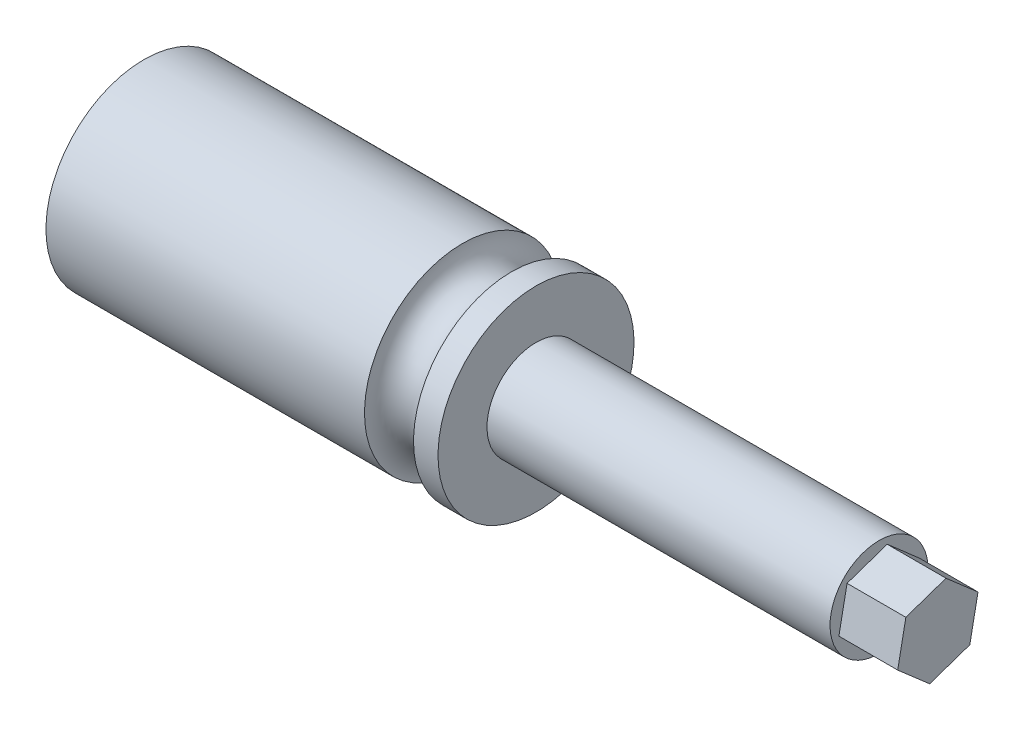
ISO-10303-21;
HEADER;
FILE_DESCRIPTION(('STEP AP214'),'2;1');
FILE_NAME('part.step','',(''),(''),'','','');
FILE_SCHEMA(('AUTOMOTIVE_DESIGN { 1 0 10303 214 1 1 1 1 }'));
ENDSEC;
DATA;
#1=APPLICATION_CONTEXT('core data for automotive mechanical design processes');
#2=APPLICATION_PROTOCOL_DEFINITION('international standard','automotive_design',2000,#1);
#3=PRODUCT_CONTEXT('',#1,'mechanical');
#4=PRODUCT('Part','Part','',(#3));
#5=PRODUCT_RELATED_PRODUCT_CATEGORY('part','',(#4));
#6=PRODUCT_DEFINITION_FORMATION('','',#4);
#7=PRODUCT_DEFINITION_CONTEXT('part definition',#1,'design');
#8=PRODUCT_DEFINITION('design','',#6,#7);
#9=PRODUCT_DEFINITION_SHAPE('','',#8);
#10=(LENGTH_UNIT() NAMED_UNIT(*) SI_UNIT(.MILLI.,.METRE.));
#11=(NAMED_UNIT(*) PLANE_ANGLE_UNIT() SI_UNIT($,.RADIAN.));
#12=(NAMED_UNIT(*) SI_UNIT($,.STERADIAN.) SOLID_ANGLE_UNIT());
#13=UNCERTAINTY_MEASURE_WITH_UNIT(LENGTH_MEASURE(1.E-05),#10,'distance_accuracy_value','');
#14=(GEOMETRIC_REPRESENTATION_CONTEXT(3) GLOBAL_UNCERTAINTY_ASSIGNED_CONTEXT((#13)) GLOBAL_UNIT_ASSIGNED_CONTEXT((#10,
#11,#12)) REPRESENTATION_CONTEXT('',''));
#15=CARTESIAN_POINT('',(0.,0.,0.));
#16=DIRECTION('',(0.,0.,1.));
#17=DIRECTION('',(1.,0.,0.));
#18=AXIS2_PLACEMENT_3D('',#15,#16,#17);
#19=CARTESIAN_POINT('',(88.9,0.,0.));
#20=DIRECTION('',(1.,0.,0.));
#21=DIRECTION('',(0.,1.,0.));
#22=AXIS2_PLACEMENT_3D('',#19,#20,#21);
#23=PLANE('',#22);
#24=CARTESIAN_POINT('',(88.9,0.,0.));
#25=DIRECTION('',(1.,0.,0.));
#26=DIRECTION('',(0.,1.,0.));
#27=AXIS2_PLACEMENT_3D('',#24,#25,#26);
#28=CIRCLE('',#27,12.7);
#29=CARTESIAN_POINT('',(88.9,12.7,0.));
#30=VERTEX_POINT('',#29);
#31=EDGE_CURVE('E11',#30,#30,#28,.T.);
#32=ORIENTED_EDGE('',*,*,#31,.T.);
#33=EDGE_LOOP('',(#32));
#34=FACE_BOUND('',#33,.T.);
#35=DIRECTION('',(0.,0.981295328161337,-0.192508386645191));
#36=VECTOR('',#35,1.);
#37=CARTESIAN_POINT('',(88.9,-7.23004181859264,-8.28818407743231));
#38=LINE('',#37,#36);
#39=CARTESIAN_POINT('',(88.9,-7.23004181859264,-8.28818407743231));
#40=VERTEX_POINT('',#39);
#41=CARTESIAN_POINT('',(88.9,3.56275705300176,-10.4054919240412));
#42=VERTEX_POINT('',#41);
#43=EDGE_CURVE('E120',#40,#42,#38,.T.);
#44=ORIENTED_EDGE('',*,*,#43,.F.);
#45=DIRECTION('',(0.,0.323930510804376,-0.9460808761253));
#46=VECTOR('',#45,1.);
#47=CARTESIAN_POINT('',(88.9,-10.7927988715944,2.11730784660893));
#48=LINE('',#47,#46);
#49=CARTESIAN_POINT('',(88.9,-10.7927988715944,2.11730784660893));
#50=VERTEX_POINT('',#49);
#51=EDGE_CURVE('E117',#50,#40,#48,.T.);
#52=ORIENTED_EDGE('',*,*,#51,.F.);
#53=DIRECTION('',(0.,-0.657364817356961,-0.75357248948011));
#54=VECTOR('',#53,1.);
#55=CARTESIAN_POINT('',(88.9,-3.56275705300174,10.4054919240412));
#56=LINE('',#55,#54);
#57=CARTESIAN_POINT('',(88.9,-3.56275705300174,10.4054919240412));
#58=VERTEX_POINT('',#57);
#59=EDGE_CURVE('E76',#58,#50,#56,.T.);
#60=ORIENTED_EDGE('',*,*,#59,.F.);
#61=DIRECTION('',(0.,-0.981295328161337,0.192508386645191));
#62=VECTOR('',#61,1.);
#63=CARTESIAN_POINT('',(88.9,7.23004181859266,8.28818407743232));
#64=LINE('',#63,#62);
#65=CARTESIAN_POINT('',(88.9,7.23004181859266,8.28818407743232));
#66=VERTEX_POINT('',#65);
#67=EDGE_CURVE('E125',#66,#58,#64,.T.);
#68=ORIENTED_EDGE('',*,*,#67,.F.);
#69=DIRECTION('',(0.,-0.323930510804376,0.9460808761253));
#70=VECTOR('',#69,1.);
#71=CARTESIAN_POINT('',(88.9,10.7927988715944,-2.11730784660892));
#72=LINE('',#71,#70);
#73=CARTESIAN_POINT('',(88.9,10.7927988715944,-2.11730784660892));
#74=VERTEX_POINT('',#73);
#75=EDGE_CURVE('E106',#74,#66,#72,.T.);
#76=ORIENTED_EDGE('',*,*,#75,.F.);
#77=DIRECTION('',(0.,0.657364817356961,0.75357248948011));
#78=VECTOR('',#77,1.);
#79=CARTESIAN_POINT('',(88.9,3.56275705300176,-10.4054919240412));
#80=LINE('',#79,#78);
#81=EDGE_CURVE('E122',#42,#74,#80,.T.);
#82=ORIENTED_EDGE('',*,*,#81,.F.);
#83=EDGE_LOOP('',(#44,#52,#60,#68,#76,#82));
#84=FACE_BOUND('',#83,.T.);
#85=ADVANCED_FACE('F34',(#34,#84),#23,.T.);
#86=CARTESIAN_POINT('',(0.,0.,0.));
#87=DIRECTION('',(1.,0.,0.));
#88=DIRECTION('',(0.,1.,0.));
#89=AXIS2_PLACEMENT_3D('',#86,#87,#88);
#90=CYLINDRICAL_SURFACE('',#89,12.7);
#91=CARTESIAN_POINT('',(0.,0.,0.));
#92=DIRECTION('',(1.,0.,0.));
#93=DIRECTION('',(0.,1.,0.));
#94=AXIS2_PLACEMENT_3D('',#91,#92,#93);
#95=CIRCLE('',#94,12.7);
#96=CARTESIAN_POINT('',(0.,12.7,0.));
#97=VERTEX_POINT('',#96);
#98=EDGE_CURVE('E41',#97,#97,#95,.T.);
#99=ORIENTED_EDGE('',*,*,#98,.T.);
#100=EDGE_LOOP('',(#99));
#101=FACE_BOUND('',#100,.T.);
#102=ORIENTED_EDGE('',*,*,#31,.F.);
#103=EDGE_LOOP('',(#102));
#104=FACE_BOUND('',#103,.T.);
#105=ADVANCED_FACE('F151',(#101,#104),#90,.T.);
#106=CARTESIAN_POINT('',(0.,12.7,0.));
#107=DIRECTION('',(1.,0.,0.));
#108=DIRECTION('',(0.,1.,0.));
#109=AXIS2_PLACEMENT_3D('',#106,#107,#108);
#110=PLANE('',#109);
#111=CARTESIAN_POINT('',(0.,0.,0.));
#112=DIRECTION('',(1.,0.,0.));
#113=DIRECTION('',(0.,1.,0.));
#114=AXIS2_PLACEMENT_3D('',#111,#112,#113);
#115=CIRCLE('',#114,25.4);
#116=CARTESIAN_POINT('',(0.,25.4,0.));
#117=VERTEX_POINT('',#116);
#118=EDGE_CURVE('E146',#117,#117,#115,.T.);
#119=ORIENTED_EDGE('',*,*,#118,.T.);
#120=EDGE_LOOP('',(#119));
#121=FACE_BOUND('',#120,.T.);
#122=ORIENTED_EDGE('',*,*,#98,.F.);
#123=EDGE_LOOP('',(#122));
#124=FACE_BOUND('',#123,.T.);
#125=ADVANCED_FACE('F154',(#121,#124),#110,.T.);
#126=CARTESIAN_POINT('',(0.,0.,0.));
#127=DIRECTION('',(1.,0.,0.));
#128=DIRECTION('',(0.,1.,0.));
#129=AXIS2_PLACEMENT_3D('',#126,#127,#128);
#130=CYLINDRICAL_SURFACE('',#129,25.4);
#131=CARTESIAN_POINT('',(-6.35,0.,0.));
#132=DIRECTION('',(1.,0.,0.));
#133=DIRECTION('',(0.,1.,0.));
#134=AXIS2_PLACEMENT_3D('',#131,#132,#133);
#135=CIRCLE('',#134,25.4);
#136=CARTESIAN_POINT('',(-6.35,25.4,0.));
#137=VERTEX_POINT('',#136);
#138=EDGE_CURVE('E143',#137,#137,#135,.T.);
#139=ORIENTED_EDGE('',*,*,#138,.T.);
#140=EDGE_LOOP('',(#139));
#141=FACE_BOUND('',#140,.T.);
#142=ORIENTED_EDGE('',*,*,#118,.F.);
#143=EDGE_LOOP('',(#142));
#144=FACE_BOUND('',#143,.T.);
#145=ADVANCED_FACE('F156',(#141,#144),#130,.T.);
#146=CARTESIAN_POINT('',(-12.7,0.,0.));
#147=DIRECTION('',(1.,0.,0.));
#148=DIRECTION('',(0.,1.,0.));
#149=AXIS2_PLACEMENT_3D('',#146,#147,#148);
#150=TOROIDAL_SURFACE('',#149,25.4,6.35);
#151=CARTESIAN_POINT('',(-19.05,0.,0.));
#152=DIRECTION('',(1.,0.,0.));
#153=DIRECTION('',(0.,1.,0.));
#154=AXIS2_PLACEMENT_3D('',#151,#152,#153);
#155=CIRCLE('',#154,25.4);
#156=CARTESIAN_POINT('',(-19.05,25.4,0.));
#157=VERTEX_POINT('',#156);
#158=EDGE_CURVE('E140',#157,#157,#155,.T.);
#159=ORIENTED_EDGE('',*,*,#158,.T.);
#160=EDGE_LOOP('',(#159));
#161=FACE_BOUND('',#160,.T.);
#162=ORIENTED_EDGE('',*,*,#138,.F.);
#163=EDGE_LOOP('',(#162));
#164=FACE_BOUND('',#163,.T.);
#165=ADVANCED_FACE('F163',(#161,#164),#150,.F.);
#166=CARTESIAN_POINT('',(0.,0.,0.));
#167=DIRECTION('',(1.,0.,0.));
#168=DIRECTION('',(0.,1.,0.));
#169=AXIS2_PLACEMENT_3D('',#166,#167,#168);
#170=CYLINDRICAL_SURFACE('',#169,25.4);
#171=CARTESIAN_POINT('',(-101.6,0.,0.));
#172=DIRECTION('',(1.,0.,0.));
#173=DIRECTION('',(0.,1.,0.));
#174=AXIS2_PLACEMENT_3D('',#171,#172,#173);
#175=CIRCLE('',#174,25.4);
#176=CARTESIAN_POINT('',(-101.6,25.4,0.));
#177=VERTEX_POINT('',#176);
#178=EDGE_CURVE('E137',#177,#177,#175,.T.);
#179=ORIENTED_EDGE('',*,*,#178,.T.);
#180=EDGE_LOOP('',(#179));
#181=FACE_BOUND('',#180,.T.);
#182=ORIENTED_EDGE('',*,*,#158,.F.);
#183=EDGE_LOOP('',(#182));
#184=FACE_BOUND('',#183,.T.);
#185=ADVANCED_FACE('F205',(#181,#184),#170,.T.);
#186=CARTESIAN_POINT('',(-101.6,0.,0.));
#187=DIRECTION('',(-1.,0.,0.));
#188=DIRECTION('',(0.,-1.,0.));
#189=AXIS2_PLACEMENT_3D('',#186,#187,#188);
#190=PLANE('',#189);
#191=ORIENTED_EDGE('',*,*,#178,.F.);
#192=EDGE_LOOP('',(#191));
#193=FACE_BOUND('',#192,.T.);
#194=ADVANCED_FACE('F202',(#193),#190,.T.);
#195=CARTESIAN_POINT('',(104.14,-10.7927988715944,2.11730784660893));
#196=DIRECTION('',(0.,0.9460808761253,0.323930510804376));
#197=DIRECTION('',(0.,-0.323930510804376,0.9460808761253));
#198=AXIS2_PLACEMENT_3D('',#195,#196,#197);
#199=PLANE('',#198);
#200=ORIENTED_EDGE('',*,*,#51,.T.);
#201=DIRECTION('',(-1.,0.,0.));
#202=VECTOR('',#201,1.);
#203=CARTESIAN_POINT('',(104.14,-7.23004181859264,-8.28818407743231));
#204=LINE('',#203,#202);
#205=CARTESIAN_POINT('',(104.14,-7.23004181859264,-8.28818407743231));
#206=VERTEX_POINT('',#205);
#207=EDGE_CURVE('E135',#206,#40,#204,.T.);
#208=ORIENTED_EDGE('',*,*,#207,.F.);
#209=DIRECTION('',(0.,0.323930510804376,-0.9460808761253));
#210=VECTOR('',#209,1.);
#211=CARTESIAN_POINT('',(104.14,-10.7927988715944,2.11730784660893));
#212=LINE('',#211,#210);
#213=CARTESIAN_POINT('',(104.14,-10.7927988715944,2.11730784660893));
#214=VERTEX_POINT('',#213);
#215=EDGE_CURVE('E128',#214,#206,#212,.T.);
#216=ORIENTED_EDGE('',*,*,#215,.F.);
#217=DIRECTION('',(-1.,0.,0.));
#218=VECTOR('',#217,1.);
#219=CARTESIAN_POINT('',(104.14,-10.7927988715944,2.11730784660893));
#220=LINE('',#219,#218);
#221=EDGE_CURVE('E113',#214,#50,#220,.T.);
#222=ORIENTED_EDGE('',*,*,#221,.T.);
#223=EDGE_LOOP('',(#200,#208,#216,#222));
#224=FACE_BOUND('',#223,.T.);
#225=ADVANCED_FACE('F183',(#224),#199,.F.);
#226=CARTESIAN_POINT('',(104.14,-7.23004181859264,-8.28818407743231));
#227=DIRECTION('',(0.,0.192508386645191,0.981295328161337));
#228=DIRECTION('',(0.,-0.981295328161337,0.192508386645191));
#229=AXIS2_PLACEMENT_3D('',#226,#227,#228);
#230=PLANE('',#229);
#231=ORIENTED_EDGE('',*,*,#43,.T.);
#232=DIRECTION('',(-1.,0.,0.));
#233=VECTOR('',#232,1.);
#234=CARTESIAN_POINT('',(104.14,3.56275705300176,-10.4054919240412));
#235=LINE('',#234,#233);
#236=CARTESIAN_POINT('',(104.14,3.56275705300176,-10.4054919240412));
#237=VERTEX_POINT('',#236);
#238=EDGE_CURVE('E132',#237,#42,#235,.T.);
#239=ORIENTED_EDGE('',*,*,#238,.F.);
#240=DIRECTION('',(0.,0.981295328161337,-0.192508386645191));
#241=VECTOR('',#240,1.);
#242=CARTESIAN_POINT('',(104.14,-7.23004181859264,-8.28818407743231));
#243=LINE('',#242,#241);
#244=EDGE_CURVE('E84',#206,#237,#243,.T.);
#245=ORIENTED_EDGE('',*,*,#244,.F.);
#246=ORIENTED_EDGE('',*,*,#207,.T.);
#247=EDGE_LOOP('',(#231,#239,#245,#246));
#248=FACE_BOUND('',#247,.T.);
#249=ADVANCED_FACE('F175',(#248),#230,.F.);
#250=CARTESIAN_POINT('',(104.14,3.56275705300176,-10.4054919240412));
#251=DIRECTION('',(0.,-0.753572489480109,0.657364817356961));
#252=DIRECTION('',(0.,-0.657364817356961,-0.75357248948011));
#253=AXIS2_PLACEMENT_3D('',#250,#251,#252);
#254=PLANE('',#253);
#255=ORIENTED_EDGE('',*,*,#81,.T.);
#256=DIRECTION('',(-1.,0.,0.));
#257=VECTOR('',#256,1.);
#258=CARTESIAN_POINT('',(104.14,10.7927988715944,-2.11730784660892));
#259=LINE('',#258,#257);
#260=CARTESIAN_POINT('',(104.14,10.7927988715944,-2.11730784660892));
#261=VERTEX_POINT('',#260);
#262=EDGE_CURVE('E109',#261,#74,#259,.T.);
#263=ORIENTED_EDGE('',*,*,#262,.F.);
#264=DIRECTION('',(0.,0.657364817356961,0.75357248948011));
#265=VECTOR('',#264,1.);
#266=CARTESIAN_POINT('',(104.14,3.56275705300176,-10.4054919240412));
#267=LINE('',#266,#265);
#268=EDGE_CURVE('E97',#237,#261,#267,.T.);
#269=ORIENTED_EDGE('',*,*,#268,.F.);
#270=ORIENTED_EDGE('',*,*,#238,.T.);
#271=EDGE_LOOP('',(#255,#263,#269,#270));
#272=FACE_BOUND('',#271,.T.);
#273=ADVANCED_FACE('F178',(#272),#254,.F.);
#274=CARTESIAN_POINT('',(104.14,10.7927988715944,-2.11730784660892));
#275=DIRECTION('',(0.,-0.9460808761253,-0.323930510804376));
#276=DIRECTION('',(0.,0.323930510804376,-0.946080876125301));
#277=AXIS2_PLACEMENT_3D('',#274,#275,#276);
#278=PLANE('',#277);
#279=ORIENTED_EDGE('',*,*,#75,.T.);
#280=DIRECTION('',(-1.,0.,0.));
#281=VECTOR('',#280,1.);
#282=CARTESIAN_POINT('',(104.14,7.23004181859267,8.28818407743232));
#283=LINE('',#282,#281);
#284=CARTESIAN_POINT('',(104.14,7.23004181859267,8.28818407743232));
#285=VERTEX_POINT('',#284);
#286=EDGE_CURVE('E103',#285,#66,#283,.T.);
#287=ORIENTED_EDGE('',*,*,#286,.F.);
#288=DIRECTION('',(0.,-0.323930510804376,0.9460808761253));
#289=VECTOR('',#288,1.);
#290=CARTESIAN_POINT('',(104.14,10.7927988715944,-2.11730784660892));
#291=LINE('',#290,#289);
#292=EDGE_CURVE('E91',#261,#285,#291,.T.);
#293=ORIENTED_EDGE('',*,*,#292,.F.);
#294=ORIENTED_EDGE('',*,*,#262,.T.);
#295=EDGE_LOOP('',(#279,#287,#293,#294));
#296=FACE_BOUND('',#295,.T.);
#297=ADVANCED_FACE('F104',(#296),#278,.F.);
#298=CARTESIAN_POINT('',(104.14,7.23004181859267,8.28818407743232));
#299=DIRECTION('',(0.,-0.192508386645191,-0.981295328161337));
#300=DIRECTION('',(0.,0.981295328161337,-0.192508386645191));
#301=AXIS2_PLACEMENT_3D('',#298,#299,#300);
#302=PLANE('',#301);
#303=ORIENTED_EDGE('',*,*,#67,.T.);
#304=DIRECTION('',(-1.,0.,0.));
#305=VECTOR('',#304,1.);
#306=CARTESIAN_POINT('',(104.14,-3.56275705300174,10.4054919240412));
#307=LINE('',#306,#305);
#308=CARTESIAN_POINT('',(104.14,-3.56275705300174,10.4054919240412));
#309=VERTEX_POINT('',#308);
#310=EDGE_CURVE('E48',#309,#58,#307,.T.);
#311=ORIENTED_EDGE('',*,*,#310,.F.);
#312=DIRECTION('',(0.,-0.981295328161337,0.192508386645191));
#313=VECTOR('',#312,1.);
#314=CARTESIAN_POINT('',(104.14,7.23004181859267,8.28818407743232));
#315=LINE('',#314,#313);
#316=EDGE_CURVE('E95',#285,#309,#315,.T.);
#317=ORIENTED_EDGE('',*,*,#316,.F.);
#318=ORIENTED_EDGE('',*,*,#286,.T.);
#319=EDGE_LOOP('',(#303,#311,#317,#318));
#320=FACE_BOUND('',#319,.T.);
#321=ADVANCED_FACE('F111',(#320),#302,.F.);
#322=CARTESIAN_POINT('',(104.14,-3.56275705300174,10.4054919240412));
#323=DIRECTION('',(0.,0.753572489480109,-0.657364817356961));
#324=DIRECTION('',(0.,0.657364817356961,0.753572489480109));
#325=AXIS2_PLACEMENT_3D('',#322,#323,#324);
#326=PLANE('',#325);
#327=ORIENTED_EDGE('',*,*,#59,.T.);
#328=ORIENTED_EDGE('',*,*,#221,.F.);
#329=DIRECTION('',(0.,-0.657364817356961,-0.75357248948011));
#330=VECTOR('',#329,1.);
#331=CARTESIAN_POINT('',(104.14,-3.56275705300174,10.4054919240412));
#332=LINE('',#331,#330);
#333=EDGE_CURVE('E56',#309,#214,#332,.T.);
#334=ORIENTED_EDGE('',*,*,#333,.F.);
#335=ORIENTED_EDGE('',*,*,#310,.T.);
#336=EDGE_LOOP('',(#327,#328,#334,#335));
#337=FACE_BOUND('',#336,.T.);
#338=ADVANCED_FACE('F184',(#337),#326,.F.);
#339=CARTESIAN_POINT('',(104.14,0.,0.));
#340=DIRECTION('',(1.,0.,0.));
#341=DIRECTION('',(0.,0.,-1.));
#342=AXIS2_PLACEMENT_3D('',#339,#340,#341);
#343=PLANE('',#342);
#344=ORIENTED_EDGE('',*,*,#215,.T.);
#345=ORIENTED_EDGE('',*,*,#244,.T.);
#346=ORIENTED_EDGE('',*,*,#268,.T.);
#347=ORIENTED_EDGE('',*,*,#292,.T.);
#348=ORIENTED_EDGE('',*,*,#316,.T.);
#349=ORIENTED_EDGE('',*,*,#333,.T.);
#350=EDGE_LOOP('',(#344,#345,#346,#347,#348,#349));
#351=FACE_BOUND('',#350,.T.);
#352=ADVANCED_FACE('F93',(#351),#343,.T.);
#353=CLOSED_SHELL('',(#85,#105,#125,#145,#165,#185,#194,#225,#249,#273,#297,#321,#338,#352));
#354=MANIFOLD_SOLID_BREP('B2',#353);
#355=ADVANCED_BREP_SHAPE_REPRESENTATION('',(#18,#354),#14);
#356=SHAPE_DEFINITION_REPRESENTATION(#9,#355);
ENDSEC;
END-ISO-10303-21;
